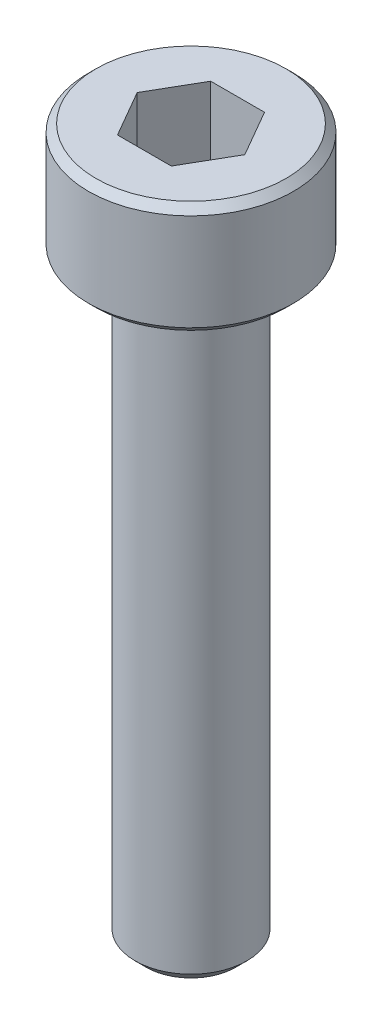
ISO-10303-21;
HEADER;
FILE_DESCRIPTION(('STEP AP214'),'2;1');
FILE_NAME('part.step','',(''),(''),'','','');
FILE_SCHEMA(('AUTOMOTIVE_DESIGN { 1 0 10303 214 1 1 1 1 }'));
ENDSEC;
DATA;
#1=APPLICATION_CONTEXT('core data for automotive mechanical design processes');
#2=APPLICATION_PROTOCOL_DEFINITION('international standard','automotive_design',2000,#1);
#3=PRODUCT_CONTEXT('',#1,'mechanical');
#4=PRODUCT('Part','Part','',(#3));
#5=PRODUCT_RELATED_PRODUCT_CATEGORY('part','',(#4));
#6=PRODUCT_DEFINITION_FORMATION('','',#4);
#7=PRODUCT_DEFINITION_CONTEXT('part definition',#1,'design');
#8=PRODUCT_DEFINITION('design','',#6,#7);
#9=PRODUCT_DEFINITION_SHAPE('','',#8);
#10=(LENGTH_UNIT() NAMED_UNIT(*) SI_UNIT(.MILLI.,.METRE.));
#11=(NAMED_UNIT(*) PLANE_ANGLE_UNIT() SI_UNIT($,.RADIAN.));
#12=(NAMED_UNIT(*) SI_UNIT($,.STERADIAN.) SOLID_ANGLE_UNIT());
#13=UNCERTAINTY_MEASURE_WITH_UNIT(LENGTH_MEASURE(1.E-05),#10,'distance_accuracy_value','');
#14=(GEOMETRIC_REPRESENTATION_CONTEXT(3) GLOBAL_UNCERTAINTY_ASSIGNED_CONTEXT((#13)) GLOBAL_UNIT_ASSIGNED_CONTEXT((#10,
#11,#12)) REPRESENTATION_CONTEXT('',''));
#15=CARTESIAN_POINT('',(0.,0.,0.));
#16=DIRECTION('',(0.,0.,1.));
#17=DIRECTION('',(1.,0.,0.));
#18=AXIS2_PLACEMENT_3D('',#15,#16,#17);
#19=CARTESIAN_POINT('',(0.721687836487033,17.,1.25));
#20=DIRECTION('',(0.866025403784439,0.,0.5));
#21=DIRECTION('',(0.5,0.,-0.866025403784439));
#22=AXIS2_PLACEMENT_3D('',#19,#20,#21);
#23=PLANE('',#22);
#24=DIRECTION('',(0.5,0.,-0.866025403784439));
#25=VECTOR('',#24,1.);
#26=CARTESIAN_POINT('',(0.721687836487033,17.,1.25));
#27=LINE('',#26,#25);
#28=CARTESIAN_POINT('',(0.721687836487033,17.,1.25));
#29=VERTEX_POINT('',#28);
#30=CARTESIAN_POINT('',(1.44337567297406,17.,0.));
#31=VERTEX_POINT('',#30);
#32=EDGE_CURVE('E66',#29,#31,#27,.T.);
#33=ORIENTED_EDGE('',*,*,#32,.F.);
#34=DIRECTION('',(0.,1.,0.));
#35=VECTOR('',#34,1.);
#36=CARTESIAN_POINT('',(0.721687836487033,17.,1.25));
#37=LINE('',#36,#35);
#38=CARTESIAN_POINT('',(0.721687836487033,19.,1.25));
#39=VERTEX_POINT('',#38);
#40=EDGE_CURVE('E85',#29,#39,#37,.T.);
#41=ORIENTED_EDGE('',*,*,#40,.T.);
#42=DIRECTION('',(0.5,0.,-0.866025403784439));
#43=VECTOR('',#42,1.);
#44=CARTESIAN_POINT('',(0.721687836487033,19.,1.25));
#45=LINE('',#44,#43);
#46=CARTESIAN_POINT('',(1.44337567297406,19.,0.));
#47=VERTEX_POINT('',#46);
#48=EDGE_CURVE('E73',#47,#39,#45,.F.);
#49=ORIENTED_EDGE('',*,*,#48,.F.);
#50=DIRECTION('',(0.,1.,0.));
#51=VECTOR('',#50,1.);
#52=CARTESIAN_POINT('',(1.44337567297406,17.,0.));
#53=LINE('',#52,#51);
#54=EDGE_CURVE('E80',#47,#31,#53,.F.);
#55=ORIENTED_EDGE('',*,*,#54,.T.);
#56=EDGE_LOOP('',(#33,#41,#49,#55));
#57=FACE_BOUND('',#56,.T.);
#58=ADVANCED_FACE('F17',(#57),#23,.F.);
#59=CARTESIAN_POINT('',(1.44337567297406,17.,0.));
#60=DIRECTION('',(0.866025403784438,0.,-0.5));
#61=DIRECTION('',(-0.5,0.,-0.866025403784438));
#62=AXIS2_PLACEMENT_3D('',#59,#60,#61);
#63=PLANE('',#62);
#64=DIRECTION('',(-0.5,0.,-0.866025403784438));
#65=VECTOR('',#64,1.);
#66=CARTESIAN_POINT('',(1.44337567297406,17.,0.));
#67=LINE('',#66,#65);
#68=CARTESIAN_POINT('',(0.721687836487031,17.,-1.25));
#69=VERTEX_POINT('',#68);
#70=EDGE_CURVE('E89',#31,#69,#67,.T.);
#71=ORIENTED_EDGE('',*,*,#70,.F.);
#72=ORIENTED_EDGE('',*,*,#54,.F.);
#73=DIRECTION('',(-0.5,0.,-0.866025403784438));
#74=VECTOR('',#73,1.);
#75=CARTESIAN_POINT('',(1.44337567297406,19.,0.));
#76=LINE('',#75,#74);
#77=CARTESIAN_POINT('',(0.721687836487032,19.,-1.25));
#78=VERTEX_POINT('',#77);
#79=EDGE_CURVE('E70',#78,#47,#76,.F.);
#80=ORIENTED_EDGE('',*,*,#79,.F.);
#81=DIRECTION('',(0.,1.,0.));
#82=VECTOR('',#81,1.);
#83=CARTESIAN_POINT('',(0.721687836487031,17.,-1.25));
#84=LINE('',#83,#82);
#85=EDGE_CURVE('E133',#78,#69,#84,.F.);
#86=ORIENTED_EDGE('',*,*,#85,.T.);
#87=EDGE_LOOP('',(#71,#72,#80,#86));
#88=FACE_BOUND('',#87,.T.);
#89=ADVANCED_FACE('F88',(#88),#63,.F.);
#90=CARTESIAN_POINT('',(-0.721687836487032,17.,1.25));
#91=DIRECTION('',(0.,0.,1.));
#92=DIRECTION('',(1.,0.,0.));
#93=AXIS2_PLACEMENT_3D('',#90,#91,#92);
#94=PLANE('',#93);
#95=DIRECTION('',(1.,0.,0.));
#96=VECTOR('',#95,1.);
#97=CARTESIAN_POINT('',(1.44337567297406,17.,1.25));
#98=LINE('',#97,#96);
#99=CARTESIAN_POINT('',(-0.721687836487032,17.,1.25));
#100=VERTEX_POINT('',#99);
#101=EDGE_CURVE('E131',#100,#29,#98,.T.);
#102=ORIENTED_EDGE('',*,*,#101,.F.);
#103=DIRECTION('',(0.,1.,0.));
#104=VECTOR('',#103,1.);
#105=CARTESIAN_POINT('',(-0.721687836487032,17.,1.25));
#106=LINE('',#105,#104);
#107=CARTESIAN_POINT('',(-0.721687836487032,19.,1.25));
#108=VERTEX_POINT('',#107);
#109=EDGE_CURVE('E121',#100,#108,#106,.T.);
#110=ORIENTED_EDGE('',*,*,#109,.T.);
#111=DIRECTION('',(1.,0.,0.));
#112=VECTOR('',#111,1.);
#113=CARTESIAN_POINT('',(-0.721687836487032,19.,1.25));
#114=LINE('',#113,#112);
#115=EDGE_CURVE('E91',#39,#108,#114,.F.);
#116=ORIENTED_EDGE('',*,*,#115,.F.);
#117=ORIENTED_EDGE('',*,*,#40,.F.);
#118=EDGE_LOOP('',(#102,#110,#116,#117));
#119=FACE_BOUND('',#118,.T.);
#120=ADVANCED_FACE('F138',(#119),#94,.F.);
#121=CARTESIAN_POINT('',(0.721687836487031,17.,-1.25));
#122=DIRECTION('',(0.,0.,-1.));
#123=DIRECTION('',(-1.,0.,0.));
#124=AXIS2_PLACEMENT_3D('',#121,#122,#123);
#125=PLANE('',#124);
#126=DIRECTION('',(1.,0.,0.));
#127=VECTOR('',#126,1.);
#128=CARTESIAN_POINT('',(1.44337567297406,17.,-1.25));
#129=LINE('',#128,#127);
#130=CARTESIAN_POINT('',(-0.721687836487032,17.,-1.25));
#131=VERTEX_POINT('',#130);
#132=EDGE_CURVE('E128',#69,#131,#129,.F.);
#133=ORIENTED_EDGE('',*,*,#132,.F.);
#134=ORIENTED_EDGE('',*,*,#85,.F.);
#135=DIRECTION('',(-1.,0.,0.));
#136=VECTOR('',#135,1.);
#137=CARTESIAN_POINT('',(0.721687836487031,19.,-1.25));
#138=LINE('',#137,#136);
#139=CARTESIAN_POINT('',(-0.721687836487032,19.,-1.25));
#140=VERTEX_POINT('',#139);
#141=EDGE_CURVE('E75',#140,#78,#138,.F.);
#142=ORIENTED_EDGE('',*,*,#141,.F.);
#143=DIRECTION('',(0.,1.,0.));
#144=VECTOR('',#143,1.);
#145=CARTESIAN_POINT('',(-0.721687836487032,17.,-1.25));
#146=LINE('',#145,#144);
#147=EDGE_CURVE('E119',#140,#131,#146,.F.);
#148=ORIENTED_EDGE('',*,*,#147,.T.);
#149=EDGE_LOOP('',(#133,#134,#142,#148));
#150=FACE_BOUND('',#149,.T.);
#151=ADVANCED_FACE('F150',(#150),#125,.F.);
#152=CARTESIAN_POINT('',(1.44337567297406,17.,0.));
#153=DIRECTION('',(0.,1.,0.));
#154=DIRECTION('',(0.,0.,1.));
#155=AXIS2_PLACEMENT_3D('',#152,#153,#154);
#156=PLANE('',#155);
#157=ORIENTED_EDGE('',*,*,#132,.T.);
#158=DIRECTION('',(-0.5,0.,0.866025403784439));
#159=VECTOR('',#158,1.);
#160=CARTESIAN_POINT('',(-0.721687836487032,17.,-1.25));
#161=LINE('',#160,#159);
#162=CARTESIAN_POINT('',(-1.44337567297406,17.,0.));
#163=VERTEX_POINT('',#162);
#164=EDGE_CURVE('E117',#131,#163,#161,.T.);
#165=ORIENTED_EDGE('',*,*,#164,.T.);
#166=DIRECTION('',(0.5,0.,0.866025403784438));
#167=VECTOR('',#166,1.);
#168=CARTESIAN_POINT('',(-1.44337567297406,17.,0.));
#169=LINE('',#168,#167);
#170=EDGE_CURVE('E124',#163,#100,#169,.T.);
#171=ORIENTED_EDGE('',*,*,#170,.T.);
#172=ORIENTED_EDGE('',*,*,#101,.T.);
#173=ORIENTED_EDGE('',*,*,#32,.T.);
#174=ORIENTED_EDGE('',*,*,#70,.T.);
#175=EDGE_LOOP('',(#157,#165,#171,#172,#173,#174));
#176=FACE_BOUND('',#175,.T.);
#177=ADVANCED_FACE('F151',(#176),#156,.T.);
#178=CARTESIAN_POINT('',(-1.44337567297406,17.,0.));
#179=DIRECTION('',(-0.866025403784438,0.,0.5));
#180=DIRECTION('',(0.5,0.,0.866025403784438));
#181=AXIS2_PLACEMENT_3D('',#178,#179,#180);
#182=PLANE('',#181);
#183=ORIENTED_EDGE('',*,*,#170,.F.);
#184=DIRECTION('',(0.,1.,0.));
#185=VECTOR('',#184,1.);
#186=CARTESIAN_POINT('',(-1.44337567297407,17.,0.));
#187=LINE('',#186,#185);
#188=CARTESIAN_POINT('',(-1.44337567297406,19.,0.));
#189=VERTEX_POINT('',#188);
#190=EDGE_CURVE('E115',#163,#189,#187,.T.);
#191=ORIENTED_EDGE('',*,*,#190,.T.);
#192=DIRECTION('',(0.5,0.,0.866025403784438));
#193=VECTOR('',#192,1.);
#194=CARTESIAN_POINT('',(-1.44337567297406,19.,0.));
#195=LINE('',#194,#193);
#196=EDGE_CURVE('E35',#108,#189,#195,.F.);
#197=ORIENTED_EDGE('',*,*,#196,.F.);
#198=ORIENTED_EDGE('',*,*,#109,.F.);
#199=EDGE_LOOP('',(#183,#191,#197,#198));
#200=FACE_BOUND('',#199,.T.);
#201=ADVANCED_FACE('F141',(#200),#182,.F.);
#202=CARTESIAN_POINT('',(-0.721687836487032,17.,-1.25));
#203=DIRECTION('',(-0.866025403784439,0.,-0.5));
#204=DIRECTION('',(-0.5,0.,0.866025403784439));
#205=AXIS2_PLACEMENT_3D('',#202,#203,#204);
#206=PLANE('',#205);
#207=ORIENTED_EDGE('',*,*,#164,.F.);
#208=ORIENTED_EDGE('',*,*,#147,.F.);
#209=DIRECTION('',(0.5,0.,-0.866025403784438));
#210=VECTOR('',#209,1.);
#211=CARTESIAN_POINT('',(-1.44337567297406,19.,0.));
#212=LINE('',#211,#210);
#213=EDGE_CURVE('E113',#189,#140,#212,.T.);
#214=ORIENTED_EDGE('',*,*,#213,.F.);
#215=ORIENTED_EDGE('',*,*,#190,.F.);
#216=EDGE_LOOP('',(#207,#208,#214,#215));
#217=FACE_BOUND('',#216,.T.);
#218=ADVANCED_FACE('F147',(#217),#206,.F.);
#219=CARTESIAN_POINT('',(0.,19.,-2.75));
#220=DIRECTION('',(0.,1.,0.));
#221=DIRECTION('',(0.,0.,1.));
#222=AXIS2_PLACEMENT_3D('',#219,#220,#221);
#223=PLANE('',#222);
#224=CARTESIAN_POINT('',(0.,18.9999999999486,0.));
#225=DIRECTION('',(0.,-1.,0.));
#226=DIRECTION('',(0.,0.,-1.));
#227=AXIS2_PLACEMENT_3D('',#224,#225,#226);
#228=CIRCLE('',#227,2.55000000004202);
#229=CARTESIAN_POINT('',(0.,18.9999999999486,-2.55000000004202));
#230=VERTEX_POINT('',#229);
#231=EDGE_CURVE('E20',#230,#230,#228,.T.);
#232=ORIENTED_EDGE('',*,*,#231,.F.);
#233=EDGE_LOOP('',(#232));
#234=FACE_BOUND('',#233,.T.);
#235=ORIENTED_EDGE('',*,*,#196,.T.);
#236=ORIENTED_EDGE('',*,*,#213,.T.);
#237=ORIENTED_EDGE('',*,*,#141,.T.);
#238=ORIENTED_EDGE('',*,*,#79,.T.);
#239=ORIENTED_EDGE('',*,*,#48,.T.);
#240=ORIENTED_EDGE('',*,*,#115,.T.);
#241=EDGE_LOOP('',(#235,#236,#237,#238,#239,#240));
#242=FACE_BOUND('',#241,.T.);
#243=ADVANCED_FACE('F72',(#234,#242),#223,.T.);
#244=CARTESIAN_POINT('',(0.,18.8000000001125,0.));
#245=DIRECTION('',(0.,-1.,0.));
#246=DIRECTION('',(0.,0.,-1.));
#247=AXIS2_PLACEMENT_3D('',#244,#245,#246);
#248=CONICAL_SURFACE('',#247,2.74999999987813,0.785398163397448);
#249=CARTESIAN_POINT('',(0.,18.8,0.));
#250=DIRECTION('',(0.,-1.,0.));
#251=DIRECTION('',(0.,0.,-1.));
#252=AXIS2_PLACEMENT_3D('',#249,#250,#251);
#253=CIRCLE('',#252,2.75);
#254=CARTESIAN_POINT('',(0.,18.8,-2.75));
#255=VERTEX_POINT('',#254);
#256=EDGE_CURVE('E106',#255,#255,#253,.T.);
#257=ORIENTED_EDGE('',*,*,#256,.F.);
#258=EDGE_LOOP('',(#257));
#259=FACE_BOUND('',#258,.T.);
#260=ORIENTED_EDGE('',*,*,#231,.T.);
#261=EDGE_LOOP('',(#260));
#262=FACE_BOUND('',#261,.T.);
#263=ADVANCED_FACE('F186',(#259,#262),#248,.T.);
#264=CARTESIAN_POINT('',(0.,0.,0.));
#265=DIRECTION('',(0.,-1.,0.));
#266=DIRECTION('',(0.,0.,-1.));
#267=AXIS2_PLACEMENT_3D('',#264,#265,#266);
#268=CYLINDRICAL_SURFACE('',#267,2.75);
#269=CARTESIAN_POINT('',(0.,16.1999999999694,0.));
#270=DIRECTION('',(0.,1.,0.));
#271=DIRECTION('',(0.,0.,1.));
#272=AXIS2_PLACEMENT_3D('',#269,#270,#271);
#273=CIRCLE('',#272,2.74999999993497);
#274=CARTESIAN_POINT('',(0.,16.1999999999694,2.74999999993497));
#275=VERTEX_POINT('',#274);
#276=EDGE_CURVE('E102',#275,#275,#273,.F.);
#277=ORIENTED_EDGE('',*,*,#276,.F.);
#278=EDGE_LOOP('',(#277));
#279=FACE_BOUND('',#278,.T.);
#280=ORIENTED_EDGE('',*,*,#256,.T.);
#281=EDGE_LOOP('',(#280));
#282=FACE_BOUND('',#281,.T.);
#283=ADVANCED_FACE('F183',(#279,#282),#268,.T.);
#284=CARTESIAN_POINT('',(0.,16.1999999998557,0.));
#285=DIRECTION('',(0.,1.,0.));
#286=DIRECTION('',(0.,0.,1.));
#287=AXIS2_PLACEMENT_3D('',#284,#285,#286);
#288=CONICAL_SURFACE('',#287,2.74999999982128,0.785398163397448);
#289=ORIENTED_EDGE('',*,*,#276,.T.);
#290=EDGE_LOOP('',(#289));
#291=FACE_BOUND('',#290,.T.);
#292=CARTESIAN_POINT('',(0.,16.0000000000196,0.));
#293=DIRECTION('',(0.,1.,0.));
#294=DIRECTION('',(0.,0.,1.));
#295=AXIS2_PLACEMENT_3D('',#292,#293,#294);
#296=CIRCLE('',#295,2.54999999998518);
#297=CARTESIAN_POINT('',(0.,16.0000000000196,2.54999999998518));
#298=VERTEX_POINT('',#297);
#299=EDGE_CURVE('E100',#298,#298,#296,.F.);
#300=ORIENTED_EDGE('',*,*,#299,.F.);
#301=EDGE_LOOP('',(#300));
#302=FACE_BOUND('',#301,.T.);
#303=ADVANCED_FACE('F179',(#291,#302),#288,.T.);
#304=CARTESIAN_POINT('',(0.,0.,0.));
#305=DIRECTION('',(0.,-1.,0.));
#306=DIRECTION('',(0.,0.,-1.));
#307=AXIS2_PLACEMENT_3D('',#304,#305,#306);
#308=PLANE('',#307);
#309=CARTESIAN_POINT('',(0.,-5.6843418860808E-11,0.));
#310=DIRECTION('',(0.,1.,0.));
#311=DIRECTION('',(0.,0.,1.));
#312=AXIS2_PLACEMENT_3D('',#309,#310,#311);
#313=CIRCLE('',#312,1.19999999998299);
#314=CARTESIAN_POINT('',(0.,-5.6843418860808E-11,1.19999999998299));
#315=VERTEX_POINT('',#314);
#316=EDGE_CURVE('E98',#315,#315,#313,.T.);
#317=ORIENTED_EDGE('',*,*,#316,.F.);
#318=EDGE_LOOP('',(#317));
#319=FACE_BOUND('',#318,.T.);
#320=ADVANCED_FACE('F176',(#319),#308,.T.);
#321=CARTESIAN_POINT('',(0.,16.,-1.5));
#322=DIRECTION('',(0.,-1.,0.));
#323=DIRECTION('',(0.,0.,-1.));
#324=AXIS2_PLACEMENT_3D('',#321,#322,#323);
#325=PLANE('',#324);
#326=ORIENTED_EDGE('',*,*,#299,.T.);
#327=EDGE_LOOP('',(#326));
#328=FACE_BOUND('',#327,.T.);
#329=CARTESIAN_POINT('',(0.,16.,0.));
#330=DIRECTION('',(0.,-1.,0.));
#331=DIRECTION('',(0.,0.,-1.));
#332=AXIS2_PLACEMENT_3D('',#329,#330,#331);
#333=CIRCLE('',#332,1.5);
#334=CARTESIAN_POINT('',(0.,16.,-1.5));
#335=VERTEX_POINT('',#334);
#336=EDGE_CURVE('E26',#335,#335,#333,.T.);
#337=ORIENTED_EDGE('',*,*,#336,.F.);
#338=EDGE_LOOP('',(#337));
#339=FACE_BOUND('',#338,.T.);
#340=ADVANCED_FACE('F169',(#328,#339),#325,.T.);
#341=CARTESIAN_POINT('',(0.,0.300000000038381,0.));
#342=DIRECTION('',(0.,1.,0.));
#343=DIRECTION('',(0.,0.,1.));
#344=AXIS2_PLACEMENT_3D('',#341,#342,#343);
#345=CONICAL_SURFACE('',#344,1.50000000002137,0.785398163302709);
#346=CARTESIAN_POINT('',(0.,0.300000000000006,0.));
#347=DIRECTION('',(0.,-1.,0.));
#348=DIRECTION('',(0.,0.,-1.));
#349=AXIS2_PLACEMENT_3D('',#346,#347,#348);
#350=CIRCLE('',#349,1.5);
#351=CARTESIAN_POINT('',(0.,0.300000000000006,-1.5));
#352=VERTEX_POINT('',#351);
#353=EDGE_CURVE('E11',#352,#352,#350,.F.);
#354=ORIENTED_EDGE('',*,*,#353,.F.);
#355=EDGE_LOOP('',(#354));
#356=FACE_BOUND('',#355,.T.);
#357=ORIENTED_EDGE('',*,*,#316,.T.);
#358=EDGE_LOOP('',(#357));
#359=FACE_BOUND('',#358,.T.);
#360=ADVANCED_FACE('F163',(#356,#359),#345,.T.);
#361=CARTESIAN_POINT('',(0.,0.,0.));
#362=DIRECTION('',(0.,-1.,0.));
#363=DIRECTION('',(0.,0.,-1.));
#364=AXIS2_PLACEMENT_3D('',#361,#362,#363);
#365=CYLINDRICAL_SURFACE('',#364,1.5);
#366=ORIENTED_EDGE('',*,*,#353,.T.);
#367=EDGE_LOOP('',(#366));
#368=FACE_BOUND('',#367,.T.);
#369=ORIENTED_EDGE('',*,*,#336,.T.);
#370=EDGE_LOOP('',(#369));
#371=FACE_BOUND('',#370,.T.);
#372=ADVANCED_FACE('F161',(#368,#371),#365,.T.);
#373=CLOSED_SHELL('',(#58,#89,#120,#151,#177,#201,#218,#243,#263,#283,#303,#320,#340,#360,#372));
#374=MANIFOLD_SOLID_BREP('B1',#373);
#375=ADVANCED_BREP_SHAPE_REPRESENTATION('',(#18,#374),#14);
#376=SHAPE_DEFINITION_REPRESENTATION(#9,#375);
ENDSEC;
END-ISO-10303-21;
